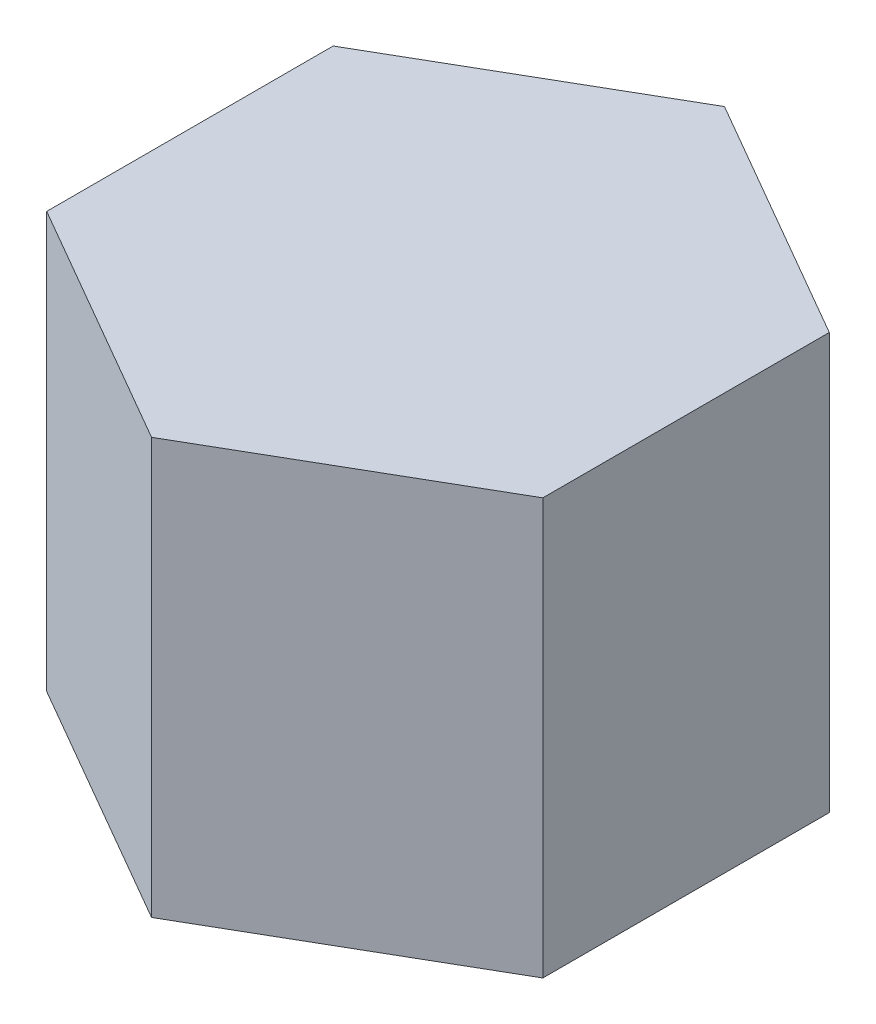
ISO-10303-21;
HEADER;
FILE_DESCRIPTION(('STEP AP214'),'2;1');
FILE_NAME('part.step','',(''),(''),'','','');
FILE_SCHEMA(('AUTOMOTIVE_DESIGN { 1 0 10303 214 1 1 1 1 }'));
ENDSEC;
DATA;
#1=APPLICATION_CONTEXT('core data for automotive mechanical design processes');
#2=APPLICATION_PROTOCOL_DEFINITION('international standard','automotive_design',2000,#1);
#3=PRODUCT_CONTEXT('',#1,'mechanical');
#4=PRODUCT('Part','Part','',(#3));
#5=PRODUCT_RELATED_PRODUCT_CATEGORY('part','',(#4));
#6=PRODUCT_DEFINITION_FORMATION('','',#4);
#7=PRODUCT_DEFINITION_CONTEXT('part definition',#1,'design');
#8=PRODUCT_DEFINITION('design','',#6,#7);
#9=PRODUCT_DEFINITION_SHAPE('','',#8);
#10=(LENGTH_UNIT() NAMED_UNIT(*) SI_UNIT(.MILLI.,.METRE.));
#11=(NAMED_UNIT(*) PLANE_ANGLE_UNIT() SI_UNIT($,.RADIAN.));
#12=(NAMED_UNIT(*) SI_UNIT($,.STERADIAN.) SOLID_ANGLE_UNIT());
#13=UNCERTAINTY_MEASURE_WITH_UNIT(LENGTH_MEASURE(1.E-05),#10,'distance_accuracy_value','');
#14=(GEOMETRIC_REPRESENTATION_CONTEXT(3) GLOBAL_UNCERTAINTY_ASSIGNED_CONTEXT((#13)) GLOBAL_UNIT_ASSIGNED_CONTEXT((#10,
#11,#12)) REPRESENTATION_CONTEXT('',''));
#15=CARTESIAN_POINT('',(0.,0.,0.));
#16=DIRECTION('',(0.,0.,1.));
#17=DIRECTION('',(1.,0.,0.));
#18=AXIS2_PLACEMENT_3D('',#15,#16,#17);
#19=CARTESIAN_POINT('',(208.642660308706,-148.537700895744,294.971072835632));
#20=DIRECTION('',(-0.499999999999909,0.,-0.866025403784491));
#21=DIRECTION('',(-0.866025403784491,0.,0.499999999999909));
#22=AXIS2_PLACEMENT_3D('',#19,#20,#21);
#23=PLANE('',#22);
#24=CARTESIAN_POINT('',(208.339551417381,-149.045793579175,295.146072835632));
#25=DIRECTION('',(0.866025403784491,0.,-0.499999999999909));
#26=VECTOR('',#25,1.);
#27=LINE('',#24,#26);
#28=CARTESIAN_POINT('',(208.339551417382,-149.045793579175,295.146072835632));
#29=VERTEX_POINT('',#28);
#30=CARTESIAN_POINT('',(208.642660308706,-149.045793579175,294.971072835632));
#31=VERTEX_POINT('',#30);
#32=EDGE_CURVE('E170',#29,#31,#27,.T.);
#33=ORIENTED_EDGE('',*,*,#32,.T.);
#34=CARTESIAN_POINT('',(208.642660308706,-148.537700895744,294.971072835632));
#35=DIRECTION('',(0.,-1.,0.));
#36=VECTOR('',#35,1.);
#37=LINE('',#34,#36);
#38=CARTESIAN_POINT('',(208.642660308706,-148.537700895744,294.971072835632));
#39=VERTEX_POINT('',#38);
#40=EDGE_CURVE('E35',#39,#31,#37,.T.);
#41=ORIENTED_EDGE('',*,*,#40,.F.);
#42=CARTESIAN_POINT('',(208.339551417381,-148.537700895744,295.146072835632));
#43=DIRECTION('',(0.866025403784491,0.,-0.499999999999909));
#44=VECTOR('',#43,1.);
#45=LINE('',#42,#44);
#46=CARTESIAN_POINT('',(208.339551417382,-148.537700895744,295.146072835632));
#47=VERTEX_POINT('',#46);
#48=EDGE_CURVE('E159',#47,#39,#45,.T.);
#49=ORIENTED_EDGE('',*,*,#48,.F.);
#50=CARTESIAN_POINT('',(208.339551417381,-148.537700895744,295.146072835632));
#51=DIRECTION('',(0.,-1.,0.));
#52=VECTOR('',#51,1.);
#53=LINE('',#50,#52);
#54=EDGE_CURVE('E10',#47,#29,#53,.T.);
#55=ORIENTED_EDGE('',*,*,#54,.T.);
#56=EDGE_LOOP('',(#33,#41,#49,#55));
#57=FACE_BOUND('',#56,.T.);
#58=ADVANCED_FACE('F16',(#57),#23,.F.);
#59=CARTESIAN_POINT('',(208.339551417382,-148.537700895744,295.146072835632));
#60=DIRECTION('',(0.500000000000062,0.,-0.866025403784403));
#61=DIRECTION('',(-0.866025403784403,0.,-0.500000000000062));
#62=AXIS2_PLACEMENT_3D('',#59,#60,#61);
#63=PLANE('',#62);
#64=CARTESIAN_POINT('',(208.036442526057,-149.045793579175,294.971072835632));
#65=DIRECTION('',(0.866025403784403,0.,0.500000000000062));
#66=VECTOR('',#65,1.);
#67=LINE('',#64,#66);
#68=CARTESIAN_POINT('',(208.036442526057,-149.045793579175,294.971072835632));
#69=VERTEX_POINT('',#68);
#70=EDGE_CURVE('E167',#69,#29,#67,.T.);
#71=ORIENTED_EDGE('',*,*,#70,.T.);
#72=ORIENTED_EDGE('',*,*,#54,.F.);
#73=CARTESIAN_POINT('',(208.036442526057,-148.537700895744,294.971072835632));
#74=DIRECTION('',(0.866025403784403,0.,0.500000000000062));
#75=VECTOR('',#74,1.);
#76=LINE('',#73,#75);
#77=CARTESIAN_POINT('',(208.036442526057,-148.537700895744,294.971072835632));
#78=VERTEX_POINT('',#77);
#79=EDGE_CURVE('E156',#78,#47,#76,.T.);
#80=ORIENTED_EDGE('',*,*,#79,.F.);
#81=CARTESIAN_POINT('',(208.036442526057,-148.537700895744,294.971072835632));
#82=DIRECTION('',(0.,-1.,0.));
#83=VECTOR('',#82,1.);
#84=LINE('',#81,#83);
#85=EDGE_CURVE('E27',#78,#69,#84,.T.);
#86=ORIENTED_EDGE('',*,*,#85,.T.);
#87=EDGE_LOOP('',(#71,#72,#80,#86));
#88=FACE_BOUND('',#87,.T.);
#89=ADVANCED_FACE('F189',(#88),#63,.F.);
#90=CARTESIAN_POINT('',(208.036442526057,-148.537700895744,290.831971220494));
#91=DIRECTION('',(1.,0.,0.));
#92=DIRECTION('',(0.,1.,0.));
#93=AXIS2_PLACEMENT_3D('',#90,#91,#92);
#94=PLANE('',#93);
#95=CARTESIAN_POINT('',(208.036442526057,-149.045793579175,294.621072835632));
#96=DIRECTION('',(0.,0.,1.));
#97=VECTOR('',#96,1.);
#98=LINE('',#95,#97);
#99=CARTESIAN_POINT('',(208.036442526057,-149.045793579175,294.621072835632));
#100=VERTEX_POINT('',#99);
#101=EDGE_CURVE('E163',#100,#69,#98,.T.);
#102=ORIENTED_EDGE('',*,*,#101,.T.);
#103=ORIENTED_EDGE('',*,*,#85,.F.);
#104=CARTESIAN_POINT('',(208.036442526057,-148.537700895744,294.621072835632));
#105=DIRECTION('',(0.,0.,1.));
#106=VECTOR('',#105,1.);
#107=LINE('',#104,#106);
#108=CARTESIAN_POINT('',(208.036442526057,-148.537700895744,294.621072835632));
#109=VERTEX_POINT('',#108);
#110=EDGE_CURVE('E106',#109,#78,#107,.T.);
#111=ORIENTED_EDGE('',*,*,#110,.F.);
#112=CARTESIAN_POINT('',(208.036442526057,-148.537700895744,294.621072835632));
#113=DIRECTION('',(0.,-1.,0.));
#114=VECTOR('',#113,1.);
#115=LINE('',#112,#114);
#116=EDGE_CURVE('E94',#109,#100,#115,.T.);
#117=ORIENTED_EDGE('',*,*,#116,.T.);
#118=EDGE_LOOP('',(#102,#103,#111,#117));
#119=FACE_BOUND('',#118,.T.);
#120=ADVANCED_FACE('F198',(#119),#94,.F.);
#121=CARTESIAN_POINT('',(208.036442526057,-148.537700895744,294.621072835632));
#122=DIRECTION('',(0.499999999999978,0.,0.866025403784452));
#123=DIRECTION('',(0.866025403784452,0.,-0.499999999999978));
#124=AXIS2_PLACEMENT_3D('',#121,#122,#123);
#125=PLANE('',#124);
#126=CARTESIAN_POINT('',(208.339551417382,-149.045793579175,294.446072835632));
#127=DIRECTION('',(-0.866025403784452,0.,0.499999999999978));
#128=VECTOR('',#127,1.);
#129=LINE('',#126,#128);
#130=CARTESIAN_POINT('',(208.339551417382,-149.045793579175,294.446072835632));
#131=VERTEX_POINT('',#130);
#132=EDGE_CURVE('E162',#131,#100,#129,.T.);
#133=ORIENTED_EDGE('',*,*,#132,.T.);
#134=ORIENTED_EDGE('',*,*,#116,.F.);
#135=CARTESIAN_POINT('',(208.339551417382,-148.537700895744,294.446072835632));
#136=DIRECTION('',(-0.866025403784452,0.,0.499999999999978));
#137=VECTOR('',#136,1.);
#138=LINE('',#135,#137);
#139=CARTESIAN_POINT('',(208.339551417382,-148.537700895744,294.446072835632));
#140=VERTEX_POINT('',#139);
#141=EDGE_CURVE('E98',#140,#109,#138,.T.);
#142=ORIENTED_EDGE('',*,*,#141,.F.);
#143=CARTESIAN_POINT('',(208.339551417382,-148.537700895744,294.446072835632));
#144=DIRECTION('',(0.,-1.,0.));
#145=VECTOR('',#144,1.);
#146=LINE('',#143,#145);
#147=EDGE_CURVE('E79',#140,#131,#146,.T.);
#148=ORIENTED_EDGE('',*,*,#147,.T.);
#149=EDGE_LOOP('',(#133,#134,#142,#148));
#150=FACE_BOUND('',#149,.T.);
#151=ADVANCED_FACE('F100',(#150),#125,.F.);
#152=CARTESIAN_POINT('',(208.339551417382,-148.537700895744,294.446072835632));
#153=DIRECTION('',(-0.500000000000062,0.,0.866025403784403));
#154=DIRECTION('',(0.866025403784403,0.,0.500000000000062));
#155=AXIS2_PLACEMENT_3D('',#152,#153,#154);
#156=PLANE('',#155);
#157=CARTESIAN_POINT('',(208.642660308706,-149.045793579175,294.621072835632));
#158=DIRECTION('',(-0.866025403784403,0.,-0.500000000000062));
#159=VECTOR('',#158,1.);
#160=LINE('',#157,#159);
#161=CARTESIAN_POINT('',(208.642660308706,-149.045793579175,294.621072835632));
#162=VERTEX_POINT('',#161);
#163=EDGE_CURVE('E88',#162,#131,#160,.T.);
#164=ORIENTED_EDGE('',*,*,#163,.T.);
#165=ORIENTED_EDGE('',*,*,#147,.F.);
#166=CARTESIAN_POINT('',(208.642660308706,-148.537700895744,294.621072835632));
#167=DIRECTION('',(-0.866025403784403,0.,-0.500000000000062));
#168=VECTOR('',#167,1.);
#169=LINE('',#166,#168);
#170=CARTESIAN_POINT('',(208.642660308706,-148.537700895744,294.621072835632));
#171=VERTEX_POINT('',#170);
#172=EDGE_CURVE('E84',#171,#140,#169,.T.);
#173=ORIENTED_EDGE('',*,*,#172,.F.);
#174=CARTESIAN_POINT('',(208.642660308706,-148.537700895744,294.621072835632));
#175=DIRECTION('',(0.,-1.,0.));
#176=VECTOR('',#175,1.);
#177=LINE('',#174,#176);
#178=EDGE_CURVE('E58',#171,#162,#177,.T.);
#179=ORIENTED_EDGE('',*,*,#178,.T.);
#180=EDGE_LOOP('',(#164,#165,#173,#179));
#181=FACE_BOUND('',#180,.T.);
#182=ADVANCED_FACE('F82',(#181),#156,.F.);
#183=CARTESIAN_POINT('',(208.642660308706,-148.537700895744,290.831971220494));
#184=DIRECTION('',(-1.,0.,0.));
#185=DIRECTION('',(0.,-1.,0.));
#186=AXIS2_PLACEMENT_3D('',#183,#184,#185);
#187=PLANE('',#186);
#188=CARTESIAN_POINT('',(208.642660308706,-149.045793579175,294.971072835632));
#189=DIRECTION('',(0.,0.,-1.));
#190=VECTOR('',#189,1.);
#191=LINE('',#188,#190);
#192=EDGE_CURVE('E160',#31,#162,#191,.T.);
#193=ORIENTED_EDGE('',*,*,#192,.T.);
#194=ORIENTED_EDGE('',*,*,#178,.F.);
#195=CARTESIAN_POINT('',(208.642660308706,-148.537700895744,294.971072835632));
#196=DIRECTION('',(0.,0.,-1.));
#197=VECTOR('',#196,1.);
#198=LINE('',#195,#197);
#199=EDGE_CURVE('E112',#39,#171,#198,.T.);
#200=ORIENTED_EDGE('',*,*,#199,.F.);
#201=ORIENTED_EDGE('',*,*,#40,.T.);
#202=EDGE_LOOP('',(#193,#194,#200,#201));
#203=FACE_BOUND('',#202,.T.);
#204=ADVANCED_FACE('F131',(#203),#187,.F.);
#205=CARTESIAN_POINT('',(206.339551417382,-148.537700895744,290.831971220494));
#206=DIRECTION('',(0.,-1.,0.));
#207=DIRECTION('',(1.,0.,0.));
#208=AXIS2_PLACEMENT_3D('',#205,#206,#207);
#209=PLANE('',#208);
#210=ORIENTED_EDGE('',*,*,#48,.T.);
#211=ORIENTED_EDGE('',*,*,#199,.T.);
#212=ORIENTED_EDGE('',*,*,#172,.T.);
#213=ORIENTED_EDGE('',*,*,#141,.T.);
#214=ORIENTED_EDGE('',*,*,#110,.T.);
#215=ORIENTED_EDGE('',*,*,#79,.T.);
#216=EDGE_LOOP('',(#210,#211,#212,#213,#214,#215));
#217=FACE_BOUND('',#216,.T.);
#218=ADVANCED_FACE('F111',(#217),#209,.F.);
#219=CARTESIAN_POINT('',(206.339551417382,-149.045793579175,290.831971220494));
#220=DIRECTION('',(0.,-1.,0.));
#221=DIRECTION('',(1.,0.,0.));
#222=AXIS2_PLACEMENT_3D('',#219,#220,#221);
#223=PLANE('',#222);
#224=ORIENTED_EDGE('',*,*,#32,.F.);
#225=ORIENTED_EDGE('',*,*,#70,.F.);
#226=ORIENTED_EDGE('',*,*,#101,.F.);
#227=ORIENTED_EDGE('',*,*,#132,.F.);
#228=ORIENTED_EDGE('',*,*,#163,.F.);
#229=ORIENTED_EDGE('',*,*,#192,.F.);
#230=EDGE_LOOP('',(#224,#225,#226,#227,#228,#229));
#231=FACE_BOUND('',#230,.T.);
#232=ADVANCED_FACE('F130',(#231),#223,.T.);
#233=CLOSED_SHELL('',(#58,#89,#120,#151,#182,#204,#218,#232));
#234=MANIFOLD_SOLID_BREP('B1',#233);
#235=ADVANCED_BREP_SHAPE_REPRESENTATION('',(#18,#234),#14);
#236=SHAPE_DEFINITION_REPRESENTATION(#9,#235);
ENDSEC;
END-ISO-10303-21;
